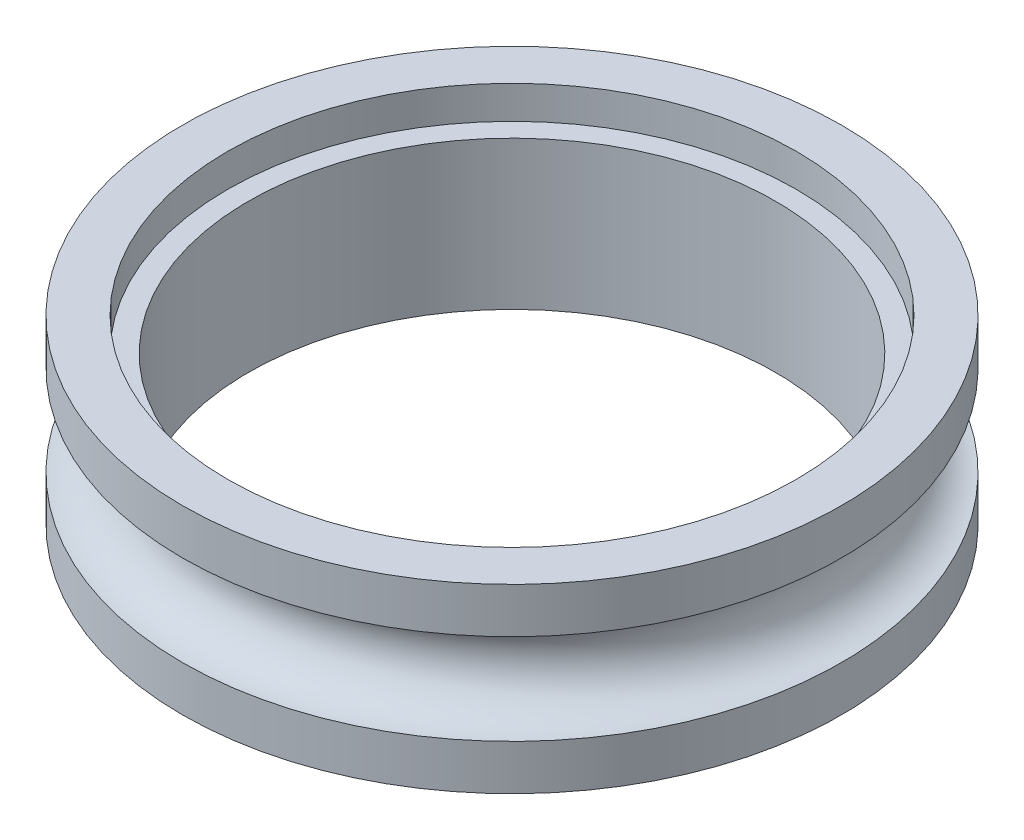
ISO-10303-21;
HEADER;
FILE_DESCRIPTION(('STEP AP214'),'2;1');
FILE_NAME('part.step','',(''),(''),'','','');
FILE_SCHEMA(('AUTOMOTIVE_DESIGN { 1 0 10303 214 1 1 1 1 }'));
ENDSEC;
DATA;
#1=APPLICATION_CONTEXT('core data for automotive mechanical design processes');
#2=APPLICATION_PROTOCOL_DEFINITION('international standard','automotive_design',2000,#1);
#3=PRODUCT_CONTEXT('',#1,'mechanical');
#4=PRODUCT('Part','Part','',(#3));
#5=PRODUCT_RELATED_PRODUCT_CATEGORY('part','',(#4));
#6=PRODUCT_DEFINITION_FORMATION('','',#4);
#7=PRODUCT_DEFINITION_CONTEXT('part definition',#1,'design');
#8=PRODUCT_DEFINITION('design','',#6,#7);
#9=PRODUCT_DEFINITION_SHAPE('','',#8);
#10=(LENGTH_UNIT() NAMED_UNIT(*) SI_UNIT(.MILLI.,.METRE.));
#11=(NAMED_UNIT(*) PLANE_ANGLE_UNIT() SI_UNIT($,.RADIAN.));
#12=(NAMED_UNIT(*) SI_UNIT($,.STERADIAN.) SOLID_ANGLE_UNIT());
#13=UNCERTAINTY_MEASURE_WITH_UNIT(LENGTH_MEASURE(1.E-05),#10,'distance_accuracy_value','');
#14=(GEOMETRIC_REPRESENTATION_CONTEXT(3) GLOBAL_UNCERTAINTY_ASSIGNED_CONTEXT((#13)) GLOBAL_UNIT_ASSIGNED_CONTEXT((#10,
#11,#12)) REPRESENTATION_CONTEXT('',''));
#15=CARTESIAN_POINT('',(0.,0.,0.));
#16=DIRECTION('',(0.,0.,1.));
#17=DIRECTION('',(1.,0.,0.));
#18=AXIS2_PLACEMENT_3D('',#15,#16,#17);
#19=CARTESIAN_POINT('',(0.,-4.572,0.));
#20=DIRECTION('',(0.,1.,0.));
#21=DIRECTION('',(0.,0.,1.));
#22=AXIS2_PLACEMENT_3D('',#19,#20,#21);
#23=CYLINDRICAL_SURFACE('',#22,8.128);
#24=CARTESIAN_POINT('',(0.,0.,0.));
#25=DIRECTION('',(0.,1.,0.));
#26=DIRECTION('',(0.,0.,1.));
#27=AXIS2_PLACEMENT_3D('',#24,#25,#26);
#28=CIRCLE('',#27,8.128);
#29=CARTESIAN_POINT('',(0.,0.,8.128));
#30=VERTEX_POINT('',#29);
#31=EDGE_CURVE('E49',#30,#30,#28,.T.);
#32=ORIENTED_EDGE('',*,*,#31,.F.);
#33=EDGE_LOOP('',(#32));
#34=FACE_BOUND('',#33,.T.);
#35=CARTESIAN_POINT('',(0.,4.572,0.));
#36=DIRECTION('',(0.,1.,0.));
#37=DIRECTION('',(0.,0.,1.));
#38=AXIS2_PLACEMENT_3D('',#35,#36,#37);
#39=CIRCLE('',#38,8.128);
#40=CARTESIAN_POINT('',(0.,4.572,8.128));
#41=VERTEX_POINT('',#40);
#42=EDGE_CURVE('E36',#41,#41,#39,.F.);
#43=ORIENTED_EDGE('',*,*,#42,.F.);
#44=EDGE_LOOP('',(#43));
#45=FACE_BOUND('',#44,.T.);
#46=ADVANCED_FACE('F32',(#34,#45),#23,.F.);
#47=CARTESIAN_POINT('',(0.,5.588,0.));
#48=DIRECTION('',(0.,-1.,0.));
#49=DIRECTION('',(0.,0.,-1.));
#50=AXIS2_PLACEMENT_3D('',#47,#48,#49);
#51=CYLINDRICAL_SURFACE('',#50,10.16);
#52=CARTESIAN_POINT('',(0.,4.191,0.));
#53=DIRECTION('',(0.,1.,0.));
#54=DIRECTION('',(0.,0.,1.));
#55=AXIS2_PLACEMENT_3D('',#52,#53,#54);
#56=CIRCLE('',#55,10.16);
#57=CARTESIAN_POINT('',(0.,4.191,10.16));
#58=VERTEX_POINT('',#57);
#59=EDGE_CURVE('E51',#58,#58,#56,.T.);
#60=ORIENTED_EDGE('',*,*,#59,.T.);
#61=EDGE_LOOP('',(#60));
#62=FACE_BOUND('',#61,.T.);
#63=CARTESIAN_POINT('',(0.,5.588,0.));
#64=DIRECTION('',(0.,1.,0.));
#65=DIRECTION('',(0.,0.,1.));
#66=AXIS2_PLACEMENT_3D('',#63,#64,#65);
#67=CIRCLE('',#66,10.16);
#68=CARTESIAN_POINT('',(0.,5.588,10.16));
#69=VERTEX_POINT('',#68);
#70=EDGE_CURVE('E10',#69,#69,#67,.T.);
#71=ORIENTED_EDGE('',*,*,#70,.F.);
#72=EDGE_LOOP('',(#71));
#73=FACE_BOUND('',#72,.T.);
#74=ADVANCED_FACE('F73',(#62,#73),#51,.T.);
#75=CARTESIAN_POINT('',(0.,5.588,0.));
#76=DIRECTION('',(0.,1.,0.));
#77=DIRECTION('',(0.,0.,1.));
#78=AXIS2_PLACEMENT_3D('',#75,#76,#77);
#79=PLANE('',#78);
#80=CARTESIAN_POINT('',(0.,5.588,0.));
#81=DIRECTION('',(0.,1.,0.));
#82=DIRECTION('',(0.,0.,1.));
#83=AXIS2_PLACEMENT_3D('',#80,#81,#82);
#84=CIRCLE('',#83,8.763);
#85=CARTESIAN_POINT('',(0.,5.588,8.763));
#86=VERTEX_POINT('',#85);
#87=EDGE_CURVE('E60',#86,#86,#84,.T.);
#88=ORIENTED_EDGE('',*,*,#87,.F.);
#89=EDGE_LOOP('',(#88));
#90=FACE_BOUND('',#89,.T.);
#91=ORIENTED_EDGE('',*,*,#70,.T.);
#92=EDGE_LOOP('',(#91));
#93=FACE_BOUND('',#92,.T.);
#94=ADVANCED_FACE('F70',(#90,#93),#79,.T.);
#95=CARTESIAN_POINT('',(0.,2.794,0.));
#96=DIRECTION('',(0.,1.,0.));
#97=DIRECTION('',(0.,0.,1.));
#98=AXIS2_PLACEMENT_3D('',#95,#96,#97);
#99=TOROIDAL_SURFACE('',#98,10.16,1.397);
#100=ORIENTED_EDGE('',*,*,#59,.F.);
#101=EDGE_LOOP('',(#100));
#102=FACE_BOUND('',#101,.T.);
#103=CARTESIAN_POINT('',(0.,1.397,0.));
#104=DIRECTION('',(0.,1.,0.));
#105=DIRECTION('',(0.,0.,1.));
#106=AXIS2_PLACEMENT_3D('',#103,#104,#105);
#107=CIRCLE('',#106,10.16);
#108=CARTESIAN_POINT('',(0.,1.397,10.16));
#109=VERTEX_POINT('',#108);
#110=EDGE_CURVE('E45',#109,#109,#107,.T.);
#111=ORIENTED_EDGE('',*,*,#110,.T.);
#112=EDGE_LOOP('',(#111));
#113=FACE_BOUND('',#112,.T.);
#114=ADVANCED_FACE('F72',(#102,#113),#99,.F.);
#115=CARTESIAN_POINT('',(0.,0.,0.));
#116=DIRECTION('',(0.,1.,0.));
#117=DIRECTION('',(0.,0.,1.));
#118=AXIS2_PLACEMENT_3D('',#115,#116,#117);
#119=PLANE('',#118);
#120=ORIENTED_EDGE('',*,*,#31,.T.);
#121=EDGE_LOOP('',(#120));
#122=FACE_BOUND('',#121,.T.);
#123=CARTESIAN_POINT('',(0.,0.,0.));
#124=DIRECTION('',(0.,1.,0.));
#125=DIRECTION('',(0.,0.,1.));
#126=AXIS2_PLACEMENT_3D('',#123,#124,#125);
#127=CIRCLE('',#126,10.16);
#128=CARTESIAN_POINT('',(0.,0.,10.16));
#129=VERTEX_POINT('',#128);
#130=EDGE_CURVE('E40',#129,#129,#127,.T.);
#131=ORIENTED_EDGE('',*,*,#130,.F.);
#132=EDGE_LOOP('',(#131));
#133=FACE_BOUND('',#132,.T.);
#134=ADVANCED_FACE('F79',(#122,#133),#119,.F.);
#135=ORIENTED_EDGE('',*,*,#110,.F.);
#136=EDGE_LOOP('',(#135));
#137=FACE_BOUND('',#136,.T.);
#138=ORIENTED_EDGE('',*,*,#130,.T.);
#139=EDGE_LOOP('',(#138));
#140=FACE_BOUND('',#139,.T.);
#141=ADVANCED_FACE('F34',(#137,#140),#51,.T.);
#142=CARTESIAN_POINT('',(0.,4.572,0.));
#143=DIRECTION('',(0.,1.,0.));
#144=DIRECTION('',(0.,0.,1.));
#145=AXIS2_PLACEMENT_3D('',#142,#143,#144);
#146=PLANE('',#145);
#147=CARTESIAN_POINT('',(0.,4.572,0.));
#148=DIRECTION('',(0.,1.,0.));
#149=DIRECTION('',(0.,0.,1.));
#150=AXIS2_PLACEMENT_3D('',#147,#148,#149);
#151=CIRCLE('',#150,8.763);
#152=CARTESIAN_POINT('',(0.,4.572,8.763));
#153=VERTEX_POINT('',#152);
#154=EDGE_CURVE('E56',#153,#153,#151,.T.);
#155=ORIENTED_EDGE('',*,*,#154,.T.);
#156=EDGE_LOOP('',(#155));
#157=FACE_BOUND('',#156,.T.);
#158=ORIENTED_EDGE('',*,*,#42,.T.);
#159=EDGE_LOOP('',(#158));
#160=FACE_BOUND('',#159,.T.);
#161=ADVANCED_FACE('F92',(#157,#160),#146,.T.);
#162=CARTESIAN_POINT('',(0.,4.572,0.));
#163=DIRECTION('',(0.,1.,0.));
#164=DIRECTION('',(0.,0.,1.));
#165=AXIS2_PLACEMENT_3D('',#162,#163,#164);
#166=CYLINDRICAL_SURFACE('',#165,8.763);
#167=ORIENTED_EDGE('',*,*,#154,.F.);
#168=EDGE_LOOP('',(#167));
#169=FACE_BOUND('',#168,.T.);
#170=ORIENTED_EDGE('',*,*,#87,.T.);
#171=EDGE_LOOP('',(#170));
#172=FACE_BOUND('',#171,.T.);
#173=ADVANCED_FACE('F68',(#169,#172),#166,.F.);
#174=CLOSED_SHELL('',(#46,#74,#94,#114,#134,#141,#161,#173));
#175=MANIFOLD_SOLID_BREP('B2',#174);
#176=ADVANCED_BREP_SHAPE_REPRESENTATION('',(#18,#175),#14);
#177=SHAPE_DEFINITION_REPRESENTATION(#9,#176);
ENDSEC;
END-ISO-10303-21;
